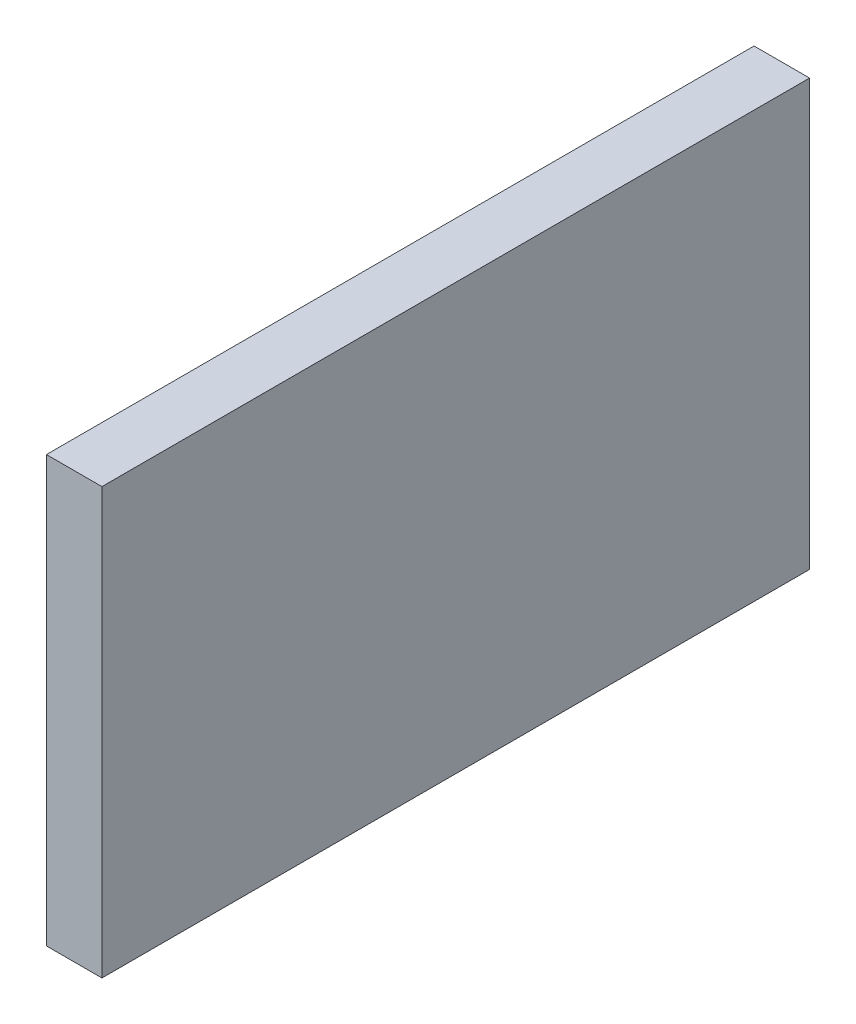
ISO-10303-21;
HEADER;
FILE_DESCRIPTION(('STEP AP214'),'2;1');
FILE_NAME('part.step','',(''),(''),'','','');
FILE_SCHEMA(('AUTOMOTIVE_DESIGN { 1 0 10303 214 1 1 1 1 }'));
ENDSEC;
DATA;
#1=APPLICATION_CONTEXT('core data for automotive mechanical design processes');
#2=APPLICATION_PROTOCOL_DEFINITION('international standard','automotive_design',2000,#1);
#3=PRODUCT_CONTEXT('',#1,'mechanical');
#4=PRODUCT('Part','Part','',(#3));
#5=PRODUCT_RELATED_PRODUCT_CATEGORY('part','',(#4));
#6=PRODUCT_DEFINITION_FORMATION('','',#4);
#7=PRODUCT_DEFINITION_CONTEXT('part definition',#1,'design');
#8=PRODUCT_DEFINITION('design','',#6,#7);
#9=PRODUCT_DEFINITION_SHAPE('','',#8);
#10=(LENGTH_UNIT() NAMED_UNIT(*) SI_UNIT(.MILLI.,.METRE.));
#11=(NAMED_UNIT(*) PLANE_ANGLE_UNIT() SI_UNIT($,.RADIAN.));
#12=(NAMED_UNIT(*) SI_UNIT($,.STERADIAN.) SOLID_ANGLE_UNIT());
#13=UNCERTAINTY_MEASURE_WITH_UNIT(LENGTH_MEASURE(1.E-05),#10,'distance_accuracy_value','');
#14=(GEOMETRIC_REPRESENTATION_CONTEXT(3) GLOBAL_UNCERTAINTY_ASSIGNED_CONTEXT((#13)) GLOBAL_UNIT_ASSIGNED_CONTEXT((#10,
#11,#12)) REPRESENTATION_CONTEXT('',''));
#15=CARTESIAN_POINT('',(0.,0.,0.));
#16=DIRECTION('',(0.,0.,1.));
#17=DIRECTION('',(1.,0.,0.));
#18=AXIS2_PLACEMENT_3D('',#15,#16,#17);
#19=CARTESIAN_POINT('',(8.35773221474386,44.8268255638794,99.2288653928388));
#20=DIRECTION('',(1.,0.,0.));
#21=DIRECTION('',(0.,1.,0.));
#22=AXIS2_PLACEMENT_3D('',#19,#20,#21);
#23=PLANE('',#22);
#24=DIRECTION('',(0.,-1.,0.));
#25=VECTOR('',#24,1.);
#26=CARTESIAN_POINT('',(8.35773221474386,44.8268255638794,76.0305319551957));
#27=LINE('',#26,#25);
#28=CARTESIAN_POINT('',(8.35773221474386,44.8268255638794,76.0305319551957));
#29=VERTEX_POINT('',#28);
#30=CARTESIAN_POINT('',(8.35773221474386,21.8232894382297,76.0305319551957));
#31=VERTEX_POINT('',#30);
#32=EDGE_CURVE('E42',#29,#31,#27,.T.);
#33=ORIENTED_EDGE('',*,*,#32,.F.);
#34=DIRECTION('',(0.,0.,-1.));
#35=VECTOR('',#34,1.);
#36=CARTESIAN_POINT('',(8.35773221474386,44.8268255638794,99.2288653928388));
#37=LINE('',#36,#35);
#38=CARTESIAN_POINT('',(8.35773221474386,44.8268255638794,37.7805319551957));
#39=VERTEX_POINT('',#38);
#40=EDGE_CURVE('E89',#29,#39,#37,.T.);
#41=ORIENTED_EDGE('',*,*,#40,.T.);
#42=DIRECTION('',(0.,-1.,0.));
#43=VECTOR('',#42,1.);
#44=CARTESIAN_POINT('',(8.35773221474386,44.8268255638794,37.7805319551957));
#45=LINE('',#44,#43);
#46=CARTESIAN_POINT('',(8.35773221474386,21.8232894382297,37.7805319551957));
#47=VERTEX_POINT('',#46);
#48=EDGE_CURVE('E80',#39,#47,#45,.T.);
#49=ORIENTED_EDGE('',*,*,#48,.T.);
#50=DIRECTION('',(0.,0.,-1.));
#51=VECTOR('',#50,1.);
#52=CARTESIAN_POINT('',(8.35773221474386,21.8232894382297,99.2288653928388));
#53=LINE('',#52,#51);
#54=EDGE_CURVE('E72',#31,#47,#53,.T.);
#55=ORIENTED_EDGE('',*,*,#54,.F.);
#56=EDGE_LOOP('',(#33,#41,#49,#55));
#57=FACE_BOUND('',#56,.T.);
#58=ADVANCED_FACE('F32',(#57),#23,.F.);
#59=CARTESIAN_POINT('',(8.35773221474386,21.8232894382297,99.2288653928388));
#60=DIRECTION('',(0.,1.,0.));
#61=DIRECTION('',(0.,0.,1.));
#62=AXIS2_PLACEMENT_3D('',#59,#60,#61);
#63=PLANE('',#62);
#64=DIRECTION('',(1.,0.,0.));
#65=VECTOR('',#64,1.);
#66=CARTESIAN_POINT('',(8.35773221474386,21.8232894382297,76.0305319551957));
#67=LINE('',#66,#65);
#68=CARTESIAN_POINT('',(11.3577322147439,21.8232894382297,76.0305319551957));
#69=VERTEX_POINT('',#68);
#70=EDGE_CURVE('E11',#31,#69,#67,.T.);
#71=ORIENTED_EDGE('',*,*,#70,.F.);
#72=ORIENTED_EDGE('',*,*,#54,.T.);
#73=DIRECTION('',(1.,0.,0.));
#74=VECTOR('',#73,1.);
#75=CARTESIAN_POINT('',(8.35773221474386,21.8232894382297,37.7805319551957));
#76=LINE('',#75,#74);
#77=CARTESIAN_POINT('',(11.3577322147439,21.8232894382297,37.7805319551957));
#78=VERTEX_POINT('',#77);
#79=EDGE_CURVE('E75',#47,#78,#76,.T.);
#80=ORIENTED_EDGE('',*,*,#79,.T.);
#81=DIRECTION('',(0.,0.,-1.));
#82=VECTOR('',#81,1.);
#83=CARTESIAN_POINT('',(11.3577322147439,21.8232894382297,99.2288653928388));
#84=LINE('',#83,#82);
#85=EDGE_CURVE('E67',#69,#78,#84,.T.);
#86=ORIENTED_EDGE('',*,*,#85,.F.);
#87=EDGE_LOOP('',(#71,#72,#80,#86));
#88=FACE_BOUND('',#87,.T.);
#89=ADVANCED_FACE('F74',(#88),#63,.F.);
#90=CARTESIAN_POINT('',(11.3577322147439,44.8268255638794,99.2288653928388));
#91=DIRECTION('',(-1.,0.,0.));
#92=DIRECTION('',(0.,-1.,0.));
#93=AXIS2_PLACEMENT_3D('',#90,#91,#92);
#94=PLANE('',#93);
#95=DIRECTION('',(0.,1.,0.));
#96=VECTOR('',#95,1.);
#97=CARTESIAN_POINT('',(11.3577322147439,44.8268255638794,76.0305319551957));
#98=LINE('',#97,#96);
#99=CARTESIAN_POINT('',(11.3577322147439,44.8268255638794,76.0305319551957));
#100=VERTEX_POINT('',#99);
#101=EDGE_CURVE('E36',#69,#100,#98,.T.);
#102=ORIENTED_EDGE('',*,*,#101,.F.);
#103=ORIENTED_EDGE('',*,*,#85,.T.);
#104=DIRECTION('',(0.,1.,0.));
#105=VECTOR('',#104,1.);
#106=CARTESIAN_POINT('',(11.3577322147439,44.8268255638794,37.7805319551957));
#107=LINE('',#106,#105);
#108=CARTESIAN_POINT('',(11.3577322147439,44.8268255638794,37.7805319551957));
#109=VERTEX_POINT('',#108);
#110=EDGE_CURVE('E86',#78,#109,#107,.T.);
#111=ORIENTED_EDGE('',*,*,#110,.T.);
#112=DIRECTION('',(0.,0.,-1.));
#113=VECTOR('',#112,1.);
#114=CARTESIAN_POINT('',(11.3577322147439,44.8268255638794,99.2288653928388));
#115=LINE('',#114,#113);
#116=EDGE_CURVE('E98',#100,#109,#115,.T.);
#117=ORIENTED_EDGE('',*,*,#116,.F.);
#118=EDGE_LOOP('',(#102,#103,#111,#117));
#119=FACE_BOUND('',#118,.T.);
#120=ADVANCED_FACE('F107',(#119),#94,.F.);
#121=CARTESIAN_POINT('',(8.35773221474386,44.8268255638794,99.2288653928388));
#122=DIRECTION('',(0.,-1.,0.));
#123=DIRECTION('',(0.,0.,-1.));
#124=AXIS2_PLACEMENT_3D('',#121,#122,#123);
#125=PLANE('',#124);
#126=DIRECTION('',(-1.,0.,0.));
#127=VECTOR('',#126,1.);
#128=CARTESIAN_POINT('',(8.35773221474386,44.8268255638794,76.0305319551957));
#129=LINE('',#128,#127);
#130=EDGE_CURVE('E94',#100,#29,#129,.T.);
#131=ORIENTED_EDGE('',*,*,#130,.F.);
#132=ORIENTED_EDGE('',*,*,#116,.T.);
#133=DIRECTION('',(-1.,0.,0.));
#134=VECTOR('',#133,1.);
#135=CARTESIAN_POINT('',(8.35773221474386,44.8268255638794,37.7805319551957));
#136=LINE('',#135,#134);
#137=EDGE_CURVE('E99',#109,#39,#136,.T.);
#138=ORIENTED_EDGE('',*,*,#137,.T.);
#139=ORIENTED_EDGE('',*,*,#40,.F.);
#140=EDGE_LOOP('',(#131,#132,#138,#139));
#141=FACE_BOUND('',#140,.T.);
#142=ADVANCED_FACE('F105',(#141),#125,.F.);
#143=CARTESIAN_POINT('',(0.,0.,37.7805319551957));
#144=DIRECTION('',(0.,0.,1.));
#145=DIRECTION('',(1.,0.,0.));
#146=AXIS2_PLACEMENT_3D('',#143,#144,#145);
#147=PLANE('',#146);
#148=ORIENTED_EDGE('',*,*,#48,.F.);
#149=ORIENTED_EDGE('',*,*,#137,.F.);
#150=ORIENTED_EDGE('',*,*,#110,.F.);
#151=ORIENTED_EDGE('',*,*,#79,.F.);
#152=EDGE_LOOP('',(#148,#149,#150,#151));
#153=FACE_BOUND('',#152,.T.);
#154=ADVANCED_FACE('F84',(#153),#147,.F.);
#155=CARTESIAN_POINT('',(0.,0.,76.0305319551957));
#156=DIRECTION('',(0.,0.,1.));
#157=DIRECTION('',(1.,0.,0.));
#158=AXIS2_PLACEMENT_3D('',#155,#156,#157);
#159=PLANE('',#158);
#160=ORIENTED_EDGE('',*,*,#101,.T.);
#161=ORIENTED_EDGE('',*,*,#130,.T.);
#162=ORIENTED_EDGE('',*,*,#32,.T.);
#163=ORIENTED_EDGE('',*,*,#70,.T.);
#164=EDGE_LOOP('',(#160,#161,#162,#163));
#165=FACE_BOUND('',#164,.T.);
#166=ADVANCED_FACE('F34',(#165),#159,.T.);
#167=CLOSED_SHELL('',(#58,#89,#120,#142,#154,#166));
#168=MANIFOLD_SOLID_BREP('B2',#167);
#169=ADVANCED_BREP_SHAPE_REPRESENTATION('',(#18,#168),#14);
#170=SHAPE_DEFINITION_REPRESENTATION(#9,#169);
ENDSEC;
END-ISO-10303-21;
